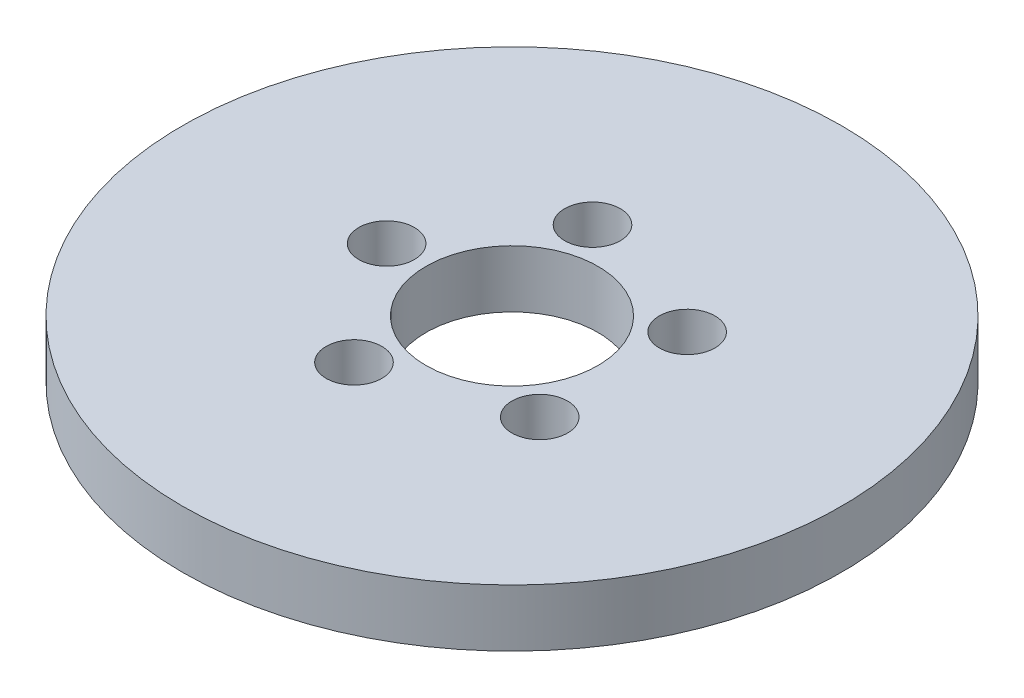
ISO-10303-21;
HEADER;
FILE_DESCRIPTION(('STEP AP214'),'2;1');
FILE_NAME('part.step','',(''),(''),'','','');
FILE_SCHEMA(('AUTOMOTIVE_DESIGN { 1 0 10303 214 1 1 1 1 }'));
ENDSEC;
DATA;
#1=APPLICATION_CONTEXT('core data for automotive mechanical design processes');
#2=APPLICATION_PROTOCOL_DEFINITION('international standard','automotive_design',2000,#1);
#3=PRODUCT_CONTEXT('',#1,'mechanical');
#4=PRODUCT('Part','Part','',(#3));
#5=PRODUCT_RELATED_PRODUCT_CATEGORY('part','',(#4));
#6=PRODUCT_DEFINITION_FORMATION('','',#4);
#7=PRODUCT_DEFINITION_CONTEXT('part definition',#1,'design');
#8=PRODUCT_DEFINITION('design','',#6,#7);
#9=PRODUCT_DEFINITION_SHAPE('','',#8);
#10=(LENGTH_UNIT() NAMED_UNIT(*) SI_UNIT(.MILLI.,.METRE.));
#11=(NAMED_UNIT(*) PLANE_ANGLE_UNIT() SI_UNIT($,.RADIAN.));
#12=(NAMED_UNIT(*) SI_UNIT($,.STERADIAN.) SOLID_ANGLE_UNIT());
#13=UNCERTAINTY_MEASURE_WITH_UNIT(LENGTH_MEASURE(1.E-05),#10,'distance_accuracy_value','');
#14=(GEOMETRIC_REPRESENTATION_CONTEXT(3) GLOBAL_UNCERTAINTY_ASSIGNED_CONTEXT((#13)) GLOBAL_UNIT_ASSIGNED_CONTEXT((#10,
#11,#12)) REPRESENTATION_CONTEXT('',''));
#15=CARTESIAN_POINT('',(0.,0.,0.));
#16=DIRECTION('',(0.,0.,1.));
#17=DIRECTION('',(1.,0.,0.));
#18=AXIS2_PLACEMENT_3D('',#15,#16,#17);
#19=CARTESIAN_POINT('',(0.,10.,0.));
#20=DIRECTION('',(0.,-1.,0.));
#21=DIRECTION('',(0.,0.,-1.));
#22=AXIS2_PLACEMENT_3D('',#19,#20,#21);
#23=CYLINDRICAL_SURFACE('',#22,57.5);
#24=CARTESIAN_POINT('',(0.,10.,0.));
#25=DIRECTION('',(0.,1.,0.));
#26=DIRECTION('',(0.,0.,1.));
#27=AXIS2_PLACEMENT_3D('',#24,#25,#26);
#28=CIRCLE('',#27,57.5);
#29=CARTESIAN_POINT('',(0.,10.,57.5));
#30=VERTEX_POINT('',#29);
#31=EDGE_CURVE('E10',#30,#30,#28,.T.);
#32=ORIENTED_EDGE('',*,*,#31,.F.);
#33=EDGE_LOOP('',(#32));
#34=FACE_BOUND('',#33,.T.);
#35=CARTESIAN_POINT('',(0.,0.,0.));
#36=DIRECTION('',(0.,1.,0.));
#37=DIRECTION('',(0.,0.,1.));
#38=AXIS2_PLACEMENT_3D('',#35,#36,#37);
#39=CIRCLE('',#38,57.5);
#40=CARTESIAN_POINT('',(0.,0.,57.5));
#41=VERTEX_POINT('',#40);
#42=EDGE_CURVE('E37',#41,#41,#39,.T.);
#43=ORIENTED_EDGE('',*,*,#42,.T.);
#44=EDGE_LOOP('',(#43));
#45=FACE_BOUND('',#44,.T.);
#46=ADVANCED_FACE('F40',(#34,#45),#23,.T.);
#47=CARTESIAN_POINT('',(0.,10.,0.));
#48=DIRECTION('',(0.,1.,0.));
#49=DIRECTION('',(0.,0.,1.));
#50=AXIS2_PLACEMENT_3D('',#47,#48,#49);
#51=PLANE('',#50);
#52=CARTESIAN_POINT('',(-6.76056894109824,10.,-20.8068917319556));
#53=DIRECTION('',(0.,1.,0.));
#54=DIRECTION('',(-0.95105651629515,0.,0.309016994374958));
#55=AXIS2_PLACEMENT_3D('',#52,#53,#54);
#56=CIRCLE('',#55,4.85320374086023);
#57=CARTESIAN_POINT('',(-11.3762399837514,10.,-19.3071692988656));
#58=VERTEX_POINT('',#57);
#59=EDGE_CURVE('E70',#58,#58,#56,.T.);
#60=ORIENTED_EDGE('',*,*,#59,.F.);
#61=EDGE_LOOP('',(#60));
#62=FACE_BOUND('',#61,.T.);
#63=CARTESIAN_POINT('',(17.6993992710813,10.,-12.8593662905879));
#64=DIRECTION('',(0.,1.,0.));
#65=DIRECTION('',(-0.58778525229248,0.,-0.809016994374942));
#66=AXIS2_PLACEMENT_3D('',#63,#64,#65);
#67=CIRCLE('',#66,4.85320374086023);
#68=CARTESIAN_POINT('',(14.846757685833,10.,-16.7856905941079));
#69=VERTEX_POINT('',#68);
#70=EDGE_CURVE('E71',#69,#69,#67,.T.);
#71=ORIENTED_EDGE('',*,*,#70,.F.);
#72=EDGE_LOOP('',(#71));
#73=FACE_BOUND('',#72,.T.);
#74=CARTESIAN_POINT('',(17.6993992710815,10.,12.8593662905877));
#75=DIRECTION('',(0.,1.,0.));
#76=DIRECTION('',(0.587785252292469,0.,-0.809016994374951));
#77=AXIS2_PLACEMENT_3D('',#74,#75,#76);
#78=CIRCLE('',#77,4.85320374086023);
#79=CARTESIAN_POINT('',(20.5520408563298,10.,8.93304198706764));
#80=VERTEX_POINT('',#79);
#81=EDGE_CURVE('E78',#80,#80,#78,.T.);
#82=ORIENTED_EDGE('',*,*,#81,.F.);
#83=EDGE_LOOP('',(#82));
#84=FACE_BOUND('',#83,.T.);
#85=CARTESIAN_POINT('',(-6.76056894109794,10.,20.8068917319557));
#86=DIRECTION('',(0.,1.,0.));
#87=DIRECTION('',(0.951056516295155,0.,0.309016994374945));
#88=AXIS2_PLACEMENT_3D('',#85,#86,#87);
#89=CIRCLE('',#88,4.85320374086023);
#90=CARTESIAN_POINT('',(-2.1448978984448,10.,22.3066141650455));
#91=VERTEX_POINT('',#90);
#92=EDGE_CURVE('E61',#91,#91,#89,.T.);
#93=ORIENTED_EDGE('',*,*,#92,.F.);
#94=EDGE_LOOP('',(#93));
#95=FACE_BOUND('',#94,.T.);
#96=CARTESIAN_POINT('',(-21.8776606599669,10.,0.));
#97=DIRECTION('',(0.,1.,0.));
#98=DIRECTION('',(0.,0.,1.));
#99=AXIS2_PLACEMENT_3D('',#96,#97,#98);
#100=CIRCLE('',#99,4.85320374086023);
#101=CARTESIAN_POINT('',(-21.8776606599669,10.,4.85320374086023));
#102=VERTEX_POINT('',#101);
#103=EDGE_CURVE('E54',#102,#102,#100,.T.);
#104=ORIENTED_EDGE('',*,*,#103,.F.);
#105=EDGE_LOOP('',(#104));
#106=FACE_BOUND('',#105,.T.);
#107=CARTESIAN_POINT('',(0.,10.,0.));
#108=DIRECTION('',(0.,1.,0.));
#109=DIRECTION('',(0.,0.,1.));
#110=AXIS2_PLACEMENT_3D('',#107,#108,#109);
#111=CIRCLE('',#110,15.);
#112=CARTESIAN_POINT('',(0.,10.,15.));
#113=VERTEX_POINT('',#112);
#114=EDGE_CURVE('E50',#113,#113,#111,.T.);
#115=ORIENTED_EDGE('',*,*,#114,.F.);
#116=EDGE_LOOP('',(#115));
#117=FACE_BOUND('',#116,.T.);
#118=ORIENTED_EDGE('',*,*,#31,.T.);
#119=EDGE_LOOP('',(#118));
#120=FACE_BOUND('',#119,.T.);
#121=ADVANCED_FACE('F94',(#62,#73,#84,#95,#106,#117,#120),#51,.T.);
#122=CARTESIAN_POINT('',(0.,0.,0.));
#123=DIRECTION('',(0.,1.,0.));
#124=DIRECTION('',(0.,0.,1.));
#125=AXIS2_PLACEMENT_3D('',#122,#123,#124);
#126=PLANE('',#125);
#127=CARTESIAN_POINT('',(0.,0.,0.));
#128=DIRECTION('',(0.,1.,0.));
#129=DIRECTION('',(0.,0.,1.));
#130=AXIS2_PLACEMENT_3D('',#127,#128,#129);
#131=CIRCLE('',#130,15.);
#132=CARTESIAN_POINT('',(0.,0.,15.));
#133=VERTEX_POINT('',#132);
#134=EDGE_CURVE('E47',#133,#133,#131,.T.);
#135=ORIENTED_EDGE('',*,*,#134,.T.);
#136=EDGE_LOOP('',(#135));
#137=FACE_BOUND('',#136,.T.);
#138=ORIENTED_EDGE('',*,*,#42,.F.);
#139=EDGE_LOOP('',(#138));
#140=FACE_BOUND('',#139,.T.);
#141=ADVANCED_FACE('F100',(#137,#140),#126,.F.);
#142=CARTESIAN_POINT('',(0.,10.,0.));
#143=DIRECTION('',(0.,-1.,0.));
#144=DIRECTION('',(0.,0.,-1.));
#145=AXIS2_PLACEMENT_3D('',#142,#143,#144);
#146=CYLINDRICAL_SURFACE('',#145,15.);
#147=ORIENTED_EDGE('',*,*,#114,.T.);
#148=EDGE_LOOP('',(#147));
#149=FACE_BOUND('',#148,.T.);
#150=ORIENTED_EDGE('',*,*,#134,.F.);
#151=EDGE_LOOP('',(#150));
#152=FACE_BOUND('',#151,.T.);
#153=ADVANCED_FACE('F106',(#149,#152),#146,.F.);
#154=CARTESIAN_POINT('',(-21.8776606599669,0.689775666652842,0.));
#155=DIRECTION('',(0.,1.,0.));
#156=DIRECTION('',(0.,0.,1.));
#157=AXIS2_PLACEMENT_3D('',#154,#155,#156);
#158=CYLINDRICAL_SURFACE('',#157,4.85320374086023);
#159=CARTESIAN_POINT('',(-21.8776606599669,0.689775666652842,0.));
#160=DIRECTION('',(0.,1.,0.));
#161=DIRECTION('',(0.,0.,1.));
#162=AXIS2_PLACEMENT_3D('',#159,#160,#161);
#163=CIRCLE('',#162,4.85320374086023);
#164=CARTESIAN_POINT('',(-21.8776606599669,0.689775666652842,4.85320374086023));
#165=VERTEX_POINT('',#164);
#166=EDGE_CURVE('E55',#165,#165,#163,.T.);
#167=ORIENTED_EDGE('',*,*,#166,.F.);
#168=EDGE_LOOP('',(#167));
#169=FACE_BOUND('',#168,.T.);
#170=ORIENTED_EDGE('',*,*,#103,.T.);
#171=EDGE_LOOP('',(#170));
#172=FACE_BOUND('',#171,.T.);
#173=ADVANCED_FACE('F108',(#169,#172),#158,.F.);
#174=CARTESIAN_POINT('',(-21.8776606599669,0.689775666652842,0.));
#175=DIRECTION('',(0.,1.,0.));
#176=DIRECTION('',(0.,0.,1.));
#177=AXIS2_PLACEMENT_3D('',#174,#175,#176);
#178=PLANE('',#177);
#179=ORIENTED_EDGE('',*,*,#166,.T.);
#180=EDGE_LOOP('',(#179));
#181=FACE_BOUND('',#180,.T.);
#182=ADVANCED_FACE('F138',(#181),#178,.T.);
#183=CARTESIAN_POINT('',(-6.76056894109794,0.689775666652842,20.8068917319557));
#184=DIRECTION('',(0.,1.,0.));
#185=DIRECTION('',(0.,0.,1.));
#186=AXIS2_PLACEMENT_3D('',#183,#184,#185);
#187=CYLINDRICAL_SURFACE('',#186,4.85320374086023);
#188=CARTESIAN_POINT('',(-6.76056894109794,0.689775666652842,20.8068917319557));
#189=DIRECTION('',(0.,1.,0.));
#190=DIRECTION('',(0.951056516295155,0.,0.309016994374945));
#191=AXIS2_PLACEMENT_3D('',#188,#189,#190);
#192=CIRCLE('',#191,4.85320374086023);
#193=CARTESIAN_POINT('',(-2.1448978984448,0.689775666652842,22.3066141650455));
#194=VERTEX_POINT('',#193);
#195=EDGE_CURVE('E59',#194,#194,#192,.T.);
#196=ORIENTED_EDGE('',*,*,#195,.F.);
#197=EDGE_LOOP('',(#196));
#198=FACE_BOUND('',#197,.T.);
#199=ORIENTED_EDGE('',*,*,#92,.T.);
#200=EDGE_LOOP('',(#199));
#201=FACE_BOUND('',#200,.T.);
#202=ADVANCED_FACE('F150',(#198,#201),#187,.F.);
#203=CARTESIAN_POINT('',(-6.76056894109794,0.689775666652842,20.8068917319557));
#204=DIRECTION('',(0.,1.,0.));
#205=DIRECTION('',(0.951056516295155,0.,0.309016994374945));
#206=AXIS2_PLACEMENT_3D('',#203,#204,#205);
#207=PLANE('',#206);
#208=ORIENTED_EDGE('',*,*,#195,.T.);
#209=EDGE_LOOP('',(#208));
#210=FACE_BOUND('',#209,.T.);
#211=ADVANCED_FACE('F89',(#210),#207,.T.);
#212=CARTESIAN_POINT('',(17.6993992710815,0.689775666652842,12.8593662905877));
#213=DIRECTION('',(0.,1.,0.));
#214=DIRECTION('',(0.,0.,1.));
#215=AXIS2_PLACEMENT_3D('',#212,#213,#214);
#216=CYLINDRICAL_SURFACE('',#215,4.85320374086023);
#217=CARTESIAN_POINT('',(17.6993992710815,0.689775666652842,12.8593662905877));
#218=DIRECTION('',(0.,1.,0.));
#219=DIRECTION('',(0.587785252292469,0.,-0.809016994374951));
#220=AXIS2_PLACEMENT_3D('',#217,#218,#219);
#221=CIRCLE('',#220,4.85320374086023);
#222=CARTESIAN_POINT('',(20.5520408563298,0.689775666652842,8.93304198706764));
#223=VERTEX_POINT('',#222);
#224=EDGE_CURVE('E63',#223,#223,#221,.T.);
#225=ORIENTED_EDGE('',*,*,#224,.F.);
#226=EDGE_LOOP('',(#225));
#227=FACE_BOUND('',#226,.T.);
#228=ORIENTED_EDGE('',*,*,#81,.T.);
#229=EDGE_LOOP('',(#228));
#230=FACE_BOUND('',#229,.T.);
#231=ADVANCED_FACE('F87',(#227,#230),#216,.F.);
#232=CARTESIAN_POINT('',(17.6993992710815,0.689775666652842,12.8593662905877));
#233=DIRECTION('',(0.,1.,0.));
#234=DIRECTION('',(0.587785252292469,0.,-0.809016994374951));
#235=AXIS2_PLACEMENT_3D('',#232,#233,#234);
#236=PLANE('',#235);
#237=ORIENTED_EDGE('',*,*,#224,.T.);
#238=EDGE_LOOP('',(#237));
#239=FACE_BOUND('',#238,.T.);
#240=ADVANCED_FACE('F84',(#239),#236,.T.);
#241=CARTESIAN_POINT('',(17.6993992710813,0.689775666652842,-12.8593662905879));
#242=DIRECTION('',(0.,1.,0.));
#243=DIRECTION('',(0.,0.,1.));
#244=AXIS2_PLACEMENT_3D('',#241,#242,#243);
#245=CYLINDRICAL_SURFACE('',#244,4.85320374086023);
#246=CARTESIAN_POINT('',(17.6993992710813,0.689775666652842,-12.8593662905879));
#247=DIRECTION('',(0.,1.,0.));
#248=DIRECTION('',(-0.58778525229248,0.,-0.809016994374942));
#249=AXIS2_PLACEMENT_3D('',#246,#247,#248);
#250=CIRCLE('',#249,4.85320374086023);
#251=CARTESIAN_POINT('',(14.846757685833,0.689775666652842,-16.7856905941079));
#252=VERTEX_POINT('',#251);
#253=EDGE_CURVE('E76',#252,#252,#250,.T.);
#254=ORIENTED_EDGE('',*,*,#253,.F.);
#255=EDGE_LOOP('',(#254));
#256=FACE_BOUND('',#255,.T.);
#257=ORIENTED_EDGE('',*,*,#70,.T.);
#258=EDGE_LOOP('',(#257));
#259=FACE_BOUND('',#258,.T.);
#260=ADVANCED_FACE('F185',(#256,#259),#245,.F.);
#261=CARTESIAN_POINT('',(17.6993992710813,0.689775666652842,-12.8593662905879));
#262=DIRECTION('',(0.,1.,0.));
#263=DIRECTION('',(-0.58778525229248,0.,-0.809016994374942));
#264=AXIS2_PLACEMENT_3D('',#261,#262,#263);
#265=PLANE('',#264);
#266=ORIENTED_EDGE('',*,*,#253,.T.);
#267=EDGE_LOOP('',(#266));
#268=FACE_BOUND('',#267,.T.);
#269=ADVANCED_FACE('F189',(#268),#265,.T.);
#270=CARTESIAN_POINT('',(-6.76056894109824,0.689775666652842,-20.8068917319556));
#271=DIRECTION('',(0.,1.,0.));
#272=DIRECTION('',(0.,0.,1.));
#273=AXIS2_PLACEMENT_3D('',#270,#271,#272);
#274=CYLINDRICAL_SURFACE('',#273,4.85320374086023);
#275=CARTESIAN_POINT('',(-6.76056894109824,0.689775666652842,-20.8068917319556));
#276=DIRECTION('',(0.,1.,0.));
#277=DIRECTION('',(-0.95105651629515,0.,0.309016994374958));
#278=AXIS2_PLACEMENT_3D('',#275,#276,#277);
#279=CIRCLE('',#278,4.85320374086023);
#280=CARTESIAN_POINT('',(-11.3762399837514,0.689775666652842,-19.3071692988656));
#281=VERTEX_POINT('',#280);
#282=EDGE_CURVE('E69',#281,#281,#279,.T.);
#283=ORIENTED_EDGE('',*,*,#282,.F.);
#284=EDGE_LOOP('',(#283));
#285=FACE_BOUND('',#284,.T.);
#286=ORIENTED_EDGE('',*,*,#59,.T.);
#287=EDGE_LOOP('',(#286));
#288=FACE_BOUND('',#287,.T.);
#289=ADVANCED_FACE('F200',(#285,#288),#274,.F.);
#290=CARTESIAN_POINT('',(-6.76056894109824,0.689775666652842,-20.8068917319556));
#291=DIRECTION('',(0.,1.,0.));
#292=DIRECTION('',(-0.95105651629515,0.,0.309016994374958));
#293=AXIS2_PLACEMENT_3D('',#290,#291,#292);
#294=PLANE('',#293);
#295=ORIENTED_EDGE('',*,*,#282,.T.);
#296=EDGE_LOOP('',(#295));
#297=FACE_BOUND('',#296,.T.);
#298=ADVANCED_FACE('F208',(#297),#294,.T.);
#299=CLOSED_SHELL('',(#46,#121,#141,#153,#173,#182,#202,#211,#231,#240,#260,#269,#289,#298));
#300=MANIFOLD_SOLID_BREP('B2',#299);
#301=ADVANCED_BREP_SHAPE_REPRESENTATION('',(#18,#300),#14);
#302=SHAPE_DEFINITION_REPRESENTATION(#9,#301);
ENDSEC;
END-ISO-10303-21;
